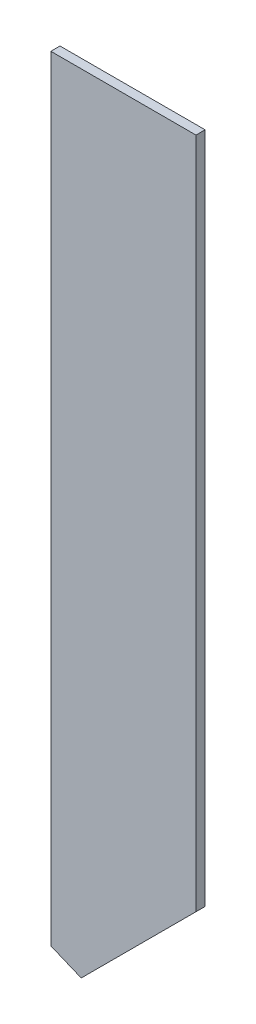
ISO-10303-21;
HEADER;
FILE_DESCRIPTION(('STEP AP214'),'2;1');
FILE_NAME('part.step','',(''),(''),'','','');
FILE_SCHEMA(('AUTOMOTIVE_DESIGN { 1 0 10303 214 1 1 1 1 }'));
ENDSEC;
DATA;
#1=APPLICATION_CONTEXT('core data for automotive mechanical design processes');
#2=APPLICATION_PROTOCOL_DEFINITION('international standard','automotive_design',2000,#1);
#3=PRODUCT_CONTEXT('',#1,'mechanical');
#4=PRODUCT('Part','Part','',(#3));
#5=PRODUCT_RELATED_PRODUCT_CATEGORY('part','',(#4));
#6=PRODUCT_DEFINITION_FORMATION('','',#4);
#7=PRODUCT_DEFINITION_CONTEXT('part definition',#1,'design');
#8=PRODUCT_DEFINITION('design','',#6,#7);
#9=PRODUCT_DEFINITION_SHAPE('','',#8);
#10=(LENGTH_UNIT() NAMED_UNIT(*) SI_UNIT(.MILLI.,.METRE.));
#11=(NAMED_UNIT(*) PLANE_ANGLE_UNIT() SI_UNIT($,.RADIAN.));
#12=(NAMED_UNIT(*) SI_UNIT($,.STERADIAN.) SOLID_ANGLE_UNIT());
#13=UNCERTAINTY_MEASURE_WITH_UNIT(LENGTH_MEASURE(1.E-05),#10,'distance_accuracy_value','');
#14=(GEOMETRIC_REPRESENTATION_CONTEXT(3) GLOBAL_UNCERTAINTY_ASSIGNED_CONTEXT((#13)) GLOBAL_UNIT_ASSIGNED_CONTEXT((#10,
#11,#12)) REPRESENTATION_CONTEXT('',''));
#15=CARTESIAN_POINT('',(0.,0.,0.));
#16=DIRECTION('',(0.,0.,1.));
#17=DIRECTION('',(1.,0.,0.));
#18=AXIS2_PLACEMENT_3D('',#15,#16,#17);
#19=CARTESIAN_POINT('',(97.1380004882812,56.0919990539551,0.));
#20=DIRECTION('',(0.,-1.,0.));
#21=DIRECTION('',(-1.,0.,0.));
#22=AXIS2_PLACEMENT_3D('',#19,#20,#21);
#23=PLANE('',#22);
#24=DIRECTION('',(-1.,0.,0.));
#25=VECTOR('',#24,1.);
#26=CARTESIAN_POINT('',(97.1380004882812,56.0919990539551,0.03556));
#27=LINE('',#26,#25);
#28=CARTESIAN_POINT('',(97.1380004882812,56.0919990539551,0.03556));
#29=VERTEX_POINT('',#28);
#30=CARTESIAN_POINT('',(96.5739974975586,56.0919990539551,0.03556));
#31=VERTEX_POINT('',#30);
#32=EDGE_CURVE('E11',#29,#31,#27,.T.);
#33=ORIENTED_EDGE('',*,*,#32,.F.);
#34=DIRECTION('',(0.,0.,1.));
#35=VECTOR('',#34,1.);
#36=CARTESIAN_POINT('',(97.1380004882812,56.0919990539551,0.));
#37=LINE('',#36,#35);
#38=CARTESIAN_POINT('',(97.1380004882812,56.0919990539551,0.));
#39=VERTEX_POINT('',#38);
#40=EDGE_CURVE('E24',#39,#29,#37,.T.);
#41=ORIENTED_EDGE('',*,*,#40,.F.);
#42=DIRECTION('',(-1.,0.,0.));
#43=VECTOR('',#42,1.);
#44=CARTESIAN_POINT('',(97.1380004882812,56.0919990539551,0.));
#45=LINE('',#44,#43);
#46=CARTESIAN_POINT('',(96.5739974975586,56.0919990539551,0.));
#47=VERTEX_POINT('',#46);
#48=EDGE_CURVE('E82',#39,#47,#45,.T.);
#49=ORIENTED_EDGE('',*,*,#48,.T.);
#50=DIRECTION('',(0.,0.,1.));
#51=VECTOR('',#50,1.);
#52=CARTESIAN_POINT('',(96.5739974975586,56.0919990539551,0.));
#53=LINE('',#52,#51);
#54=EDGE_CURVE('E37',#47,#31,#53,.T.);
#55=ORIENTED_EDGE('',*,*,#54,.T.);
#56=EDGE_LOOP('',(#33,#41,#49,#55));
#57=FACE_BOUND('',#56,.T.);
#58=ADVANCED_FACE('F17',(#57),#23,.F.);
#59=CARTESIAN_POINT('',(96.5739974975586,56.0919990539551,0.));
#60=DIRECTION('',(1.,0.,0.));
#61=DIRECTION('',(0.,-1.,0.));
#62=AXIS2_PLACEMENT_3D('',#59,#60,#61);
#63=PLANE('',#62);
#64=DIRECTION('',(0.,-1.,0.));
#65=VECTOR('',#64,1.);
#66=CARTESIAN_POINT('',(96.5739974975586,56.0919990539551,0.03556));
#67=LINE('',#66,#65);
#68=CARTESIAN_POINT('',(96.5739974975586,53.0810012817383,0.03556));
#69=VERTEX_POINT('',#68);
#70=EDGE_CURVE('E98',#31,#69,#67,.T.);
#71=ORIENTED_EDGE('',*,*,#70,.F.);
#72=ORIENTED_EDGE('',*,*,#54,.F.);
#73=DIRECTION('',(0.,-1.,0.));
#74=VECTOR('',#73,1.);
#75=CARTESIAN_POINT('',(96.5739974975586,56.0919990539551,0.));
#76=LINE('',#75,#74);
#77=CARTESIAN_POINT('',(96.5739974975586,53.0810012817383,0.));
#78=VERTEX_POINT('',#77);
#79=EDGE_CURVE('E95',#47,#78,#76,.T.);
#80=ORIENTED_EDGE('',*,*,#79,.T.);
#81=DIRECTION('',(0.,0.,1.));
#82=VECTOR('',#81,1.);
#83=CARTESIAN_POINT('',(96.5739974975586,53.0810012817383,0.));
#84=LINE('',#83,#82);
#85=EDGE_CURVE('E93',#78,#69,#84,.T.);
#86=ORIENTED_EDGE('',*,*,#85,.T.);
#87=EDGE_LOOP('',(#71,#72,#80,#86));
#88=FACE_BOUND('',#87,.T.);
#89=ADVANCED_FACE('F104',(#88),#63,.F.);
#90=CARTESIAN_POINT('',(96.5739974975586,53.0810012817383,0.));
#91=DIRECTION('',(0.383491550488571,0.923544384804473,0.));
#92=DIRECTION('',(0.923544384804473,-0.383491550488571,0.));
#93=AXIS2_PLACEMENT_3D('',#90,#91,#92);
#94=PLANE('',#93);
#95=DIRECTION('',(0.923544384804473,-0.383491550488571,0.));
#96=VECTOR('',#95,1.);
#97=CARTESIAN_POINT('',(96.5739974975586,53.0810012817383,0.03556));
#98=LINE('',#97,#96);
#99=CARTESIAN_POINT('',(96.6920013427734,53.0320014953613,0.03556));
#100=VERTEX_POINT('',#99);
#101=EDGE_CURVE('E90',#69,#100,#98,.T.);
#102=ORIENTED_EDGE('',*,*,#101,.F.);
#103=ORIENTED_EDGE('',*,*,#85,.F.);
#104=DIRECTION('',(0.923544384804473,-0.383491550488571,0.));
#105=VECTOR('',#104,1.);
#106=CARTESIAN_POINT('',(96.5739974975586,53.0810012817383,0.));
#107=LINE('',#106,#105);
#108=CARTESIAN_POINT('',(96.6920013427734,53.0320014953613,0.));
#109=VERTEX_POINT('',#108);
#110=EDGE_CURVE('E88',#78,#109,#107,.T.);
#111=ORIENTED_EDGE('',*,*,#110,.T.);
#112=DIRECTION('',(0.,0.,1.));
#113=VECTOR('',#112,1.);
#114=CARTESIAN_POINT('',(96.6920013427734,53.0320014953613,0.));
#115=LINE('',#114,#113);
#116=EDGE_CURVE('E73',#109,#100,#115,.T.);
#117=ORIENTED_EDGE('',*,*,#116,.T.);
#118=EDGE_LOOP('',(#102,#103,#111,#117));
#119=FACE_BOUND('',#118,.T.);
#120=ADVANCED_FACE('F109',(#119),#94,.F.);
#121=CARTESIAN_POINT('',(96.6920013427734,53.0320014953613,0.));
#122=DIRECTION('',(-0.707106781186548,0.707106781186548,0.));
#123=DIRECTION('',(0.707106781186548,0.707106781186548,0.));
#124=AXIS2_PLACEMENT_3D('',#121,#122,#123);
#125=PLANE('',#124);
#126=DIRECTION('',(0.707106781186548,0.707106781186548,0.));
#127=VECTOR('',#126,1.);
#128=CARTESIAN_POINT('',(96.6920013427734,53.0320014953613,0.03556));
#129=LINE('',#128,#127);
#130=CARTESIAN_POINT('',(97.1380004882812,53.4780006408691,0.03556));
#131=VERTEX_POINT('',#130);
#132=EDGE_CURVE('E77',#100,#131,#129,.T.);
#133=ORIENTED_EDGE('',*,*,#132,.F.);
#134=ORIENTED_EDGE('',*,*,#116,.F.);
#135=DIRECTION('',(0.707106781186548,0.707106781186548,0.));
#136=VECTOR('',#135,1.);
#137=CARTESIAN_POINT('',(96.6920013427734,53.0320014953613,0.));
#138=LINE('',#137,#136);
#139=CARTESIAN_POINT('',(97.1380004882812,53.4780006408691,0.));
#140=VERTEX_POINT('',#139);
#141=EDGE_CURVE('E69',#109,#140,#138,.T.);
#142=ORIENTED_EDGE('',*,*,#141,.T.);
#143=DIRECTION('',(0.,0.,1.));
#144=VECTOR('',#143,1.);
#145=CARTESIAN_POINT('',(97.1380004882812,53.4780006408691,0.));
#146=LINE('',#145,#144);
#147=EDGE_CURVE('E59',#140,#131,#146,.T.);
#148=ORIENTED_EDGE('',*,*,#147,.T.);
#149=EDGE_LOOP('',(#133,#134,#142,#148));
#150=FACE_BOUND('',#149,.T.);
#151=ADVANCED_FACE('F72',(#150),#125,.F.);
#152=CARTESIAN_POINT('',(97.1380004882812,53.4780006408691,0.));
#153=DIRECTION('',(-1.,0.,0.));
#154=DIRECTION('',(0.,1.,0.));
#155=AXIS2_PLACEMENT_3D('',#152,#153,#154);
#156=PLANE('',#155);
#157=DIRECTION('',(0.,1.,0.));
#158=VECTOR('',#157,1.);
#159=CARTESIAN_POINT('',(97.1380004882812,53.4780006408691,0.03556));
#160=LINE('',#159,#158);
#161=EDGE_CURVE('E65',#131,#29,#160,.T.);
#162=ORIENTED_EDGE('',*,*,#161,.F.);
#163=ORIENTED_EDGE('',*,*,#147,.F.);
#164=DIRECTION('',(0.,1.,0.));
#165=VECTOR('',#164,1.);
#166=CARTESIAN_POINT('',(97.1380004882812,53.4780006408691,0.));
#167=LINE('',#166,#165);
#168=EDGE_CURVE('E63',#140,#39,#167,.T.);
#169=ORIENTED_EDGE('',*,*,#168,.T.);
#170=ORIENTED_EDGE('',*,*,#40,.T.);
#171=EDGE_LOOP('',(#162,#163,#169,#170));
#172=FACE_BOUND('',#171,.T.);
#173=ADVANCED_FACE('F61',(#172),#156,.F.);
#174=CARTESIAN_POINT('',(97.1380004882812,56.0919990539551,0.));
#175=DIRECTION('',(0.,0.,-1.));
#176=DIRECTION('',(-1.,0.,0.));
#177=AXIS2_PLACEMENT_3D('',#174,#175,#176);
#178=PLANE('',#177);
#179=ORIENTED_EDGE('',*,*,#168,.F.);
#180=ORIENTED_EDGE('',*,*,#141,.F.);
#181=ORIENTED_EDGE('',*,*,#110,.F.);
#182=ORIENTED_EDGE('',*,*,#79,.F.);
#183=ORIENTED_EDGE('',*,*,#48,.F.);
#184=EDGE_LOOP('',(#179,#180,#181,#182,#183));
#185=FACE_BOUND('',#184,.T.);
#186=ADVANCED_FACE('F80',(#185),#178,.T.);
#187=CARTESIAN_POINT('',(97.1380004882812,56.0919990539551,0.03556));
#188=DIRECTION('',(0.,0.,-1.));
#189=DIRECTION('',(-1.,0.,0.));
#190=AXIS2_PLACEMENT_3D('',#187,#188,#189);
#191=PLANE('',#190);
#192=ORIENTED_EDGE('',*,*,#32,.T.);
#193=ORIENTED_EDGE('',*,*,#70,.T.);
#194=ORIENTED_EDGE('',*,*,#101,.T.);
#195=ORIENTED_EDGE('',*,*,#132,.T.);
#196=ORIENTED_EDGE('',*,*,#161,.T.);
#197=EDGE_LOOP('',(#192,#193,#194,#195,#196));
#198=FACE_BOUND('',#197,.T.);
#199=ADVANCED_FACE('F107',(#198),#191,.F.);
#200=CLOSED_SHELL('',(#58,#89,#120,#151,#173,#186,#199));
#201=MANIFOLD_SOLID_BREP('B1',#200);
#202=ADVANCED_BREP_SHAPE_REPRESENTATION('',(#18,#201),#14);
#203=SHAPE_DEFINITION_REPRESENTATION(#9,#202);
ENDSEC;
END-ISO-10303-21;
